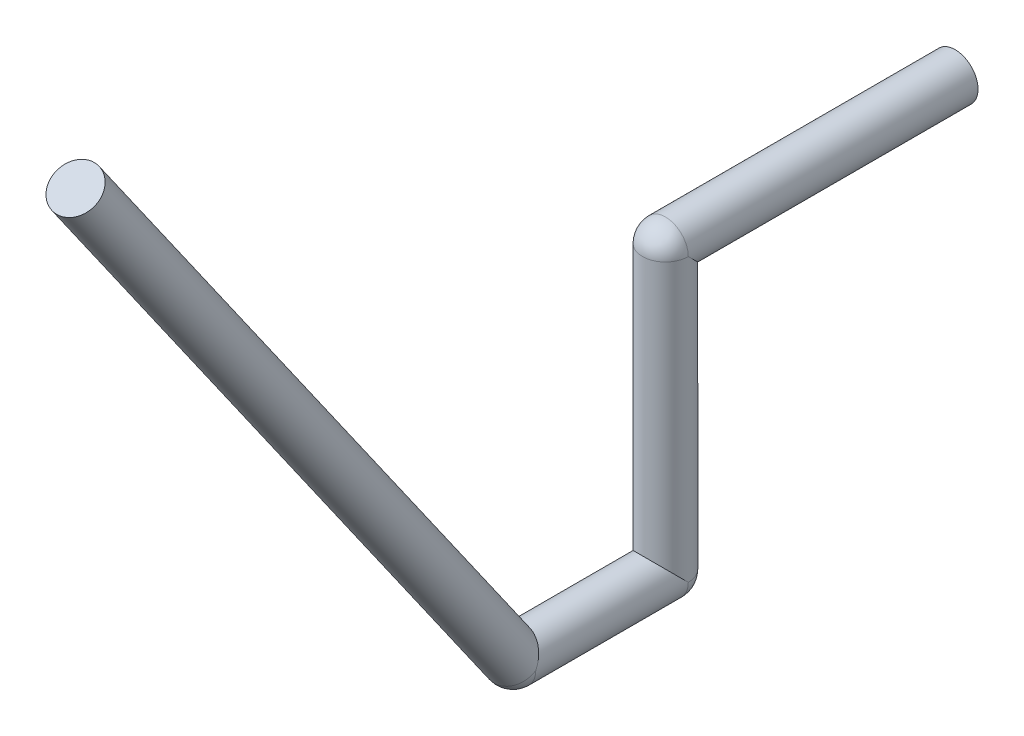
ISO-10303-21;
HEADER;
FILE_DESCRIPTION(('STEP AP214'),'2;1');
FILE_NAME('part.step','',(''),(''),'','','');
FILE_SCHEMA(('AUTOMOTIVE_DESIGN { 1 0 10303 214 1 1 1 1 }'));
ENDSEC;
DATA;
#1=APPLICATION_CONTEXT('core data for automotive mechanical design processes');
#2=APPLICATION_PROTOCOL_DEFINITION('international standard','automotive_design',2000,#1);
#3=PRODUCT_CONTEXT('',#1,'mechanical');
#4=PRODUCT('Part','Part','',(#3));
#5=PRODUCT_RELATED_PRODUCT_CATEGORY('part','',(#4));
#6=PRODUCT_DEFINITION_FORMATION('','',#4);
#7=PRODUCT_DEFINITION_CONTEXT('part definition',#1,'design');
#8=PRODUCT_DEFINITION('design','',#6,#7);
#9=PRODUCT_DEFINITION_SHAPE('','',#8);
#10=(LENGTH_UNIT() NAMED_UNIT(*) SI_UNIT(.MILLI.,.METRE.));
#11=(NAMED_UNIT(*) PLANE_ANGLE_UNIT() SI_UNIT($,.RADIAN.));
#12=(NAMED_UNIT(*) SI_UNIT($,.STERADIAN.) SOLID_ANGLE_UNIT());
#13=UNCERTAINTY_MEASURE_WITH_UNIT(LENGTH_MEASURE(1.E-05),#10,'distance_accuracy_value','');
#14=(GEOMETRIC_REPRESENTATION_CONTEXT(3) GLOBAL_UNCERTAINTY_ASSIGNED_CONTEXT((#13)) GLOBAL_UNIT_ASSIGNED_CONTEXT((#10,
#11,#12)) REPRESENTATION_CONTEXT('',''));
#15=CARTESIAN_POINT('',(0.,0.,0.));
#16=DIRECTION('',(0.,0.,1.));
#17=DIRECTION('',(1.,0.,0.));
#18=AXIS2_PLACEMENT_3D('',#15,#16,#17);
#19=CARTESIAN_POINT('',(1.8,12.49152044289,9.03576436351));
#20=DIRECTION('',(0.,0.819152044289016,0.573576436351011));
#21=DIRECTION('',(1.,0.,0.));
#22=AXIS2_PLACEMENT_3D('',#19,#20,#21);
#23=PLANE('',#22);
#24=CARTESIAN_POINT('',(1.8,12.49152044289,9.03576436351));
#25=DIRECTION('',(0.,0.819152044289016,0.573576436351011));
#26=DIRECTION('',(1.,0.,0.));
#27=AXIS2_PLACEMENT_3D('',#24,#25,#26);
#28=CIRCLE('',#27,0.3);
#29=CARTESIAN_POINT('',(1.5,12.49152044289,9.03576436351));
#30=VERTEX_POINT('',#29);
#31=EDGE_CURVE('E135',#30,#30,#28,.T.);
#32=ORIENTED_EDGE('',*,*,#31,.T.);
#33=EDGE_LOOP('',(#32));
#34=FACE_BOUND('',#33,.T.);
#35=ADVANCED_FACE('F17',(#34),#23,.T.);
#36=CARTESIAN_POINT('',(1.8,4.3,3.3));
#37=DIRECTION('',(0.,0.,1.));
#38=DIRECTION('',(1.,0.,0.));
#39=AXIS2_PLACEMENT_3D('',#36,#37,#38);
#40=SPHERICAL_SURFACE('',#39,0.3);
#41=CARTESIAN_POINT('',(1.8,4.3,3.3));
#42=DIRECTION('',(0.,0.,1.));
#43=DIRECTION('',(1.,0.,0.));
#44=AXIS2_PLACEMENT_3D('',#41,#42,#43);
#45=CIRCLE('',#44,0.3);
#46=CARTESIAN_POINT('',(1.5,4.3,3.3));
#47=VERTEX_POINT('',#46);
#48=CARTESIAN_POINT('',(2.1,4.3,3.3));
#49=VERTEX_POINT('',#48);
#50=EDGE_CURVE('E142',#47,#49,#45,.T.);
#51=ORIENTED_EDGE('',*,*,#50,.T.);
#52=CARTESIAN_POINT('',(1.8,4.3,3.3));
#53=DIRECTION('',(0.,0.819152044289016,0.573576436351011));
#54=DIRECTION('',(1.,0.,0.));
#55=AXIS2_PLACEMENT_3D('',#52,#53,#54);
#56=CIRCLE('',#55,0.3);
#57=EDGE_CURVE('E11',#47,#49,#56,.T.);
#58=ORIENTED_EDGE('',*,*,#57,.F.);
#59=EDGE_LOOP('',(#51,#58));
#60=FACE_BOUND('',#59,.T.);
#61=ADVANCED_FACE('F280',(#60),#40,.T.);
#62=CARTESIAN_POINT('',(1.8,4.3,3.3));
#63=DIRECTION('',(0.,0.819152044289016,0.573576436351011));
#64=DIRECTION('',(1.,0.,0.));
#65=AXIS2_PLACEMENT_3D('',#62,#63,#64);
#66=CYLINDRICAL_SURFACE('',#65,0.3);
#67=ORIENTED_EDGE('',*,*,#31,.F.);
#68=DIRECTION('',(0.,-0.819152044289016,-0.573576436351011));
#69=VECTOR('',#68,1.);
#70=CARTESIAN_POINT('',(1.5,4.3,3.3));
#71=LINE('',#70,#69);
#72=EDGE_CURVE('E28',#30,#47,#71,.T.);
#73=ORIENTED_EDGE('',*,*,#72,.T.);
#74=ORIENTED_EDGE('',*,*,#57,.T.);
#75=CARTESIAN_POINT('',(1.8,4.3,3.3));
#76=DIRECTION('',(0.,0.461748613235098,0.887010833178188));
#77=DIRECTION('',(0.,0.887010833178188,-0.461748613235098));
#78=AXIS2_PLACEMENT_3D('',#75,#76,#77);
#79=ELLIPSE('',#78,0.33821458406,0.3);
#80=EDGE_CURVE('E149',#49,#47,#79,.T.);
#81=ORIENTED_EDGE('',*,*,#80,.T.);
#82=ORIENTED_EDGE('',*,*,#72,.F.);
#83=EDGE_LOOP('',(#67,#73,#74,#81,#82));
#84=FACE_BOUND('',#83,.T.);
#85=ADVANCED_FACE('F271',(#84),#66,.T.);
#86=CARTESIAN_POINT('',(1.8,4.3,1.3));
#87=DIRECTION('',(0.577350269189626,0.577350269189626,0.577350269189626));
#88=DIRECTION('',(-0.707106781186548,0.,0.707106781186548));
#89=AXIS2_PLACEMENT_3D('',#86,#87,#88);
#90=SPHERICAL_SURFACE('',#89,0.3);
#91=CARTESIAN_POINT('',(1.8,4.3,1.3));
#92=DIRECTION('',(0.,-1.,0.));
#93=DIRECTION('',(1.,0.,0.));
#94=AXIS2_PLACEMENT_3D('',#91,#92,#93);
#95=CIRCLE('',#94,0.3);
#96=CARTESIAN_POINT('',(1.5,4.3,1.3));
#97=VERTEX_POINT('',#96);
#98=CARTESIAN_POINT('',(2.01213203435596,4.3,1.08786796564404));
#99=VERTEX_POINT('',#98);
#100=EDGE_CURVE('E98',#97,#99,#95,.T.);
#101=ORIENTED_EDGE('',*,*,#100,.T.);
#102=CARTESIAN_POINT('',(1.8,4.3,1.3));
#103=DIRECTION('',(-0.408248290463863,0.816496580927726,-0.408248290463863));
#104=DIRECTION('',(0.707106781186548,0.,-0.707106781186548));
#105=AXIS2_PLACEMENT_3D('',#102,#103,#104);
#106=CIRCLE('',#105,0.3);
#107=CARTESIAN_POINT('',(1.62679491924311,4.12679491924311,1.12679491924311));
#108=VERTEX_POINT('',#107);
#109=EDGE_CURVE('E138',#99,#108,#106,.T.);
#110=ORIENTED_EDGE('',*,*,#109,.T.);
#111=ORIENTED_EDGE('',*,*,#109,.F.);
#112=CARTESIAN_POINT('',(1.8,4.3,1.3));
#113=DIRECTION('',(0.,-1.,0.));
#114=DIRECTION('',(1.,0.,0.));
#115=AXIS2_PLACEMENT_3D('',#112,#113,#114);
#116=CIRCLE('',#115,0.3);
#117=CARTESIAN_POINT('',(2.1,4.3,1.3));
#118=VERTEX_POINT('',#117);
#119=EDGE_CURVE('E139',#99,#118,#116,.T.);
#120=ORIENTED_EDGE('',*,*,#119,.T.);
#121=CARTESIAN_POINT('',(1.8,4.3,1.3));
#122=DIRECTION('',(0.,0.,1.));
#123=DIRECTION('',(1.,0.,0.));
#124=AXIS2_PLACEMENT_3D('',#121,#122,#123);
#125=CIRCLE('',#124,0.3);
#126=EDGE_CURVE('E76',#97,#118,#125,.T.);
#127=ORIENTED_EDGE('',*,*,#126,.F.);
#128=EDGE_LOOP('',(#101,#110,#111,#120,#127));
#129=FACE_BOUND('',#128,.T.);
#130=ADVANCED_FACE('F262',(#129),#90,.T.);
#131=CARTESIAN_POINT('',(1.8,4.3,1.3));
#132=DIRECTION('',(0.,0.,1.));
#133=DIRECTION('',(1.,0.,0.));
#134=AXIS2_PLACEMENT_3D('',#131,#132,#133);
#135=CYLINDRICAL_SURFACE('',#134,0.3);
#136=ORIENTED_EDGE('',*,*,#50,.F.);
#137=DIRECTION('',(0.,0.,-1.));
#138=VECTOR('',#137,1.);
#139=CARTESIAN_POINT('',(1.5,4.3,1.3));
#140=LINE('',#139,#138);
#141=EDGE_CURVE('E152',#47,#97,#140,.T.);
#142=ORIENTED_EDGE('',*,*,#141,.T.);
#143=ORIENTED_EDGE('',*,*,#126,.T.);
#144=CARTESIAN_POINT('',(1.8,4.3,1.3));
#145=DIRECTION('',(0.,-0.707106781186548,0.707106781186548));
#146=DIRECTION('',(0.,-0.707106781186548,-0.707106781186548));
#147=AXIS2_PLACEMENT_3D('',#144,#145,#146);
#148=ELLIPSE('',#147,0.424264068712,0.3);
#149=EDGE_CURVE('E101',#118,#97,#148,.T.);
#150=ORIENTED_EDGE('',*,*,#149,.T.);
#151=ORIENTED_EDGE('',*,*,#141,.F.);
#152=ORIENTED_EDGE('',*,*,#80,.F.);
#153=EDGE_LOOP('',(#136,#142,#143,#150,#151,#152));
#154=FACE_BOUND('',#153,.T.);
#155=ADVANCED_FACE('F254',(#154),#135,.T.);
#156=CARTESIAN_POINT('',(1.8,8.,1.3));
#157=DIRECTION('',(0.,-1.,0.));
#158=DIRECTION('',(1.,0.,0.));
#159=AXIS2_PLACEMENT_3D('',#156,#157,#158);
#160=CYLINDRICAL_SURFACE('',#159,0.3);
#161=ORIENTED_EDGE('',*,*,#100,.F.);
#162=DIRECTION('',(0.,1.,0.));
#163=VECTOR('',#162,1.);
#164=CARTESIAN_POINT('',(1.5,8.,1.3));
#165=LINE('',#164,#163);
#166=CARTESIAN_POINT('',(1.5,8.,1.3));
#167=VERTEX_POINT('',#166);
#168=EDGE_CURVE('E21',#97,#167,#165,.T.);
#169=ORIENTED_EDGE('',*,*,#168,.T.);
#170=CARTESIAN_POINT('',(1.8,8.,1.3));
#171=DIRECTION('',(0.,-0.707106781186548,0.707106781186548));
#172=DIRECTION('',(0.,0.707106781186548,0.707106781186548));
#173=AXIS2_PLACEMENT_3D('',#170,#171,#172);
#174=ELLIPSE('',#173,0.424264068712,0.3);
#175=CARTESIAN_POINT('',(2.1,8.,1.3));
#176=VERTEX_POINT('',#175);
#177=EDGE_CURVE('E95',#167,#176,#174,.T.);
#178=ORIENTED_EDGE('',*,*,#177,.T.);
#179=CARTESIAN_POINT('',(1.8,8.,1.3));
#180=DIRECTION('',(0.,-1.,0.));
#181=DIRECTION('',(1.,0.,0.));
#182=AXIS2_PLACEMENT_3D('',#179,#180,#181);
#183=CIRCLE('',#182,0.3);
#184=EDGE_CURVE('E102',#176,#167,#183,.T.);
#185=ORIENTED_EDGE('',*,*,#184,.T.);
#186=ORIENTED_EDGE('',*,*,#168,.F.);
#187=ORIENTED_EDGE('',*,*,#149,.F.);
#188=ORIENTED_EDGE('',*,*,#119,.F.);
#189=EDGE_LOOP('',(#161,#169,#178,#185,#186,#187,#188));
#190=FACE_BOUND('',#189,.T.);
#191=ADVANCED_FACE('F19',(#190),#160,.T.);
#192=CARTESIAN_POINT('',(1.8,8.,1.3));
#193=DIRECTION('',(0.577350269189625,0.577350269189628,0.577350269189625));
#194=DIRECTION('',(-0.707106781186548,0.,0.707106781186548));
#195=AXIS2_PLACEMENT_3D('',#192,#193,#194);
#196=SPHERICAL_SURFACE('',#195,0.3);
#197=ORIENTED_EDGE('',*,*,#184,.F.);
#198=CARTESIAN_POINT('',(1.8,8.,1.3));
#199=DIRECTION('',(0.,0.,1.));
#200=DIRECTION('',(1.,0.,0.));
#201=AXIS2_PLACEMENT_3D('',#198,#199,#200);
#202=CIRCLE('',#201,0.3);
#203=CARTESIAN_POINT('',(2.06832815729997,8.13416407864999,1.3));
#204=VERTEX_POINT('',#203);
#205=EDGE_CURVE('E109',#176,#204,#202,.T.);
#206=ORIENTED_EDGE('',*,*,#205,.T.);
#207=CARTESIAN_POINT('',(1.8,8.,1.3));
#208=DIRECTION('',(-0.408248290463863,0.816496580927726,-0.408248290463863));
#209=DIRECTION('',(0.707106781186548,0.,-0.707106781186548));
#210=AXIS2_PLACEMENT_3D('',#207,#208,#209);
#211=CIRCLE('',#210,0.3);
#212=CARTESIAN_POINT('',(1.97320508075689,8.17320508075689,1.47320508075689));
#213=VERTEX_POINT('',#212);
#214=EDGE_CURVE('E108',#213,#204,#211,.T.);
#215=ORIENTED_EDGE('',*,*,#214,.F.);
#216=ORIENTED_EDGE('',*,*,#214,.T.);
#217=CARTESIAN_POINT('',(1.8,8.,1.3));
#218=DIRECTION('',(0.,0.,1.));
#219=DIRECTION('',(1.,0.,0.));
#220=AXIS2_PLACEMENT_3D('',#217,#218,#219);
#221=CIRCLE('',#220,0.3);
#222=EDGE_CURVE('E112',#204,#167,#221,.T.);
#223=ORIENTED_EDGE('',*,*,#222,.T.);
#224=EDGE_LOOP('',(#197,#206,#215,#216,#223));
#225=FACE_BOUND('',#224,.T.);
#226=ADVANCED_FACE('F114',(#225),#196,.T.);
#227=CARTESIAN_POINT('',(1.8,8.,-2.5));
#228=DIRECTION('',(0.,0.,1.));
#229=DIRECTION('',(1.,0.,0.));
#230=AXIS2_PLACEMENT_3D('',#227,#228,#229);
#231=CYLINDRICAL_SURFACE('',#230,0.3);
#232=ORIENTED_EDGE('',*,*,#177,.F.);
#233=DIRECTION('',(0.,0.,-1.));
#234=VECTOR('',#233,1.);
#235=CARTESIAN_POINT('',(1.5,8.,-2.5));
#236=LINE('',#235,#234);
#237=CARTESIAN_POINT('',(1.5,8.,-2.5));
#238=VERTEX_POINT('',#237);
#239=EDGE_CURVE('E118',#167,#238,#236,.T.);
#240=ORIENTED_EDGE('',*,*,#239,.T.);
#241=CARTESIAN_POINT('',(1.8,8.,-2.5));
#242=DIRECTION('',(0.,0.,1.));
#243=DIRECTION('',(1.,0.,0.));
#244=AXIS2_PLACEMENT_3D('',#241,#242,#243);
#245=CIRCLE('',#244,0.3);
#246=EDGE_CURVE('E122',#238,#238,#245,.T.);
#247=ORIENTED_EDGE('',*,*,#246,.T.);
#248=ORIENTED_EDGE('',*,*,#239,.F.);
#249=ORIENTED_EDGE('',*,*,#222,.F.);
#250=ORIENTED_EDGE('',*,*,#205,.F.);
#251=EDGE_LOOP('',(#232,#240,#247,#248,#249,#250));
#252=FACE_BOUND('',#251,.T.);
#253=ADVANCED_FACE('F120',(#252),#231,.T.);
#254=CARTESIAN_POINT('',(1.8,8.,-2.5));
#255=DIRECTION('',(0.,0.,1.));
#256=DIRECTION('',(1.,0.,0.));
#257=AXIS2_PLACEMENT_3D('',#254,#255,#256);
#258=PLANE('',#257);
#259=ORIENTED_EDGE('',*,*,#246,.F.);
#260=EDGE_LOOP('',(#259));
#261=FACE_BOUND('',#260,.T.);
#262=ADVANCED_FACE('F221',(#261),#258,.F.);
#263=CLOSED_SHELL('',(#35,#61,#85,#130,#155,#191,#226,#253,#262));
#264=MANIFOLD_SOLID_BREP('B1',#263);
#265=ADVANCED_BREP_SHAPE_REPRESENTATION('',(#18,#264),#14);
#266=SHAPE_DEFINITION_REPRESENTATION(#9,#265);
ENDSEC;
END-ISO-10303-21;
